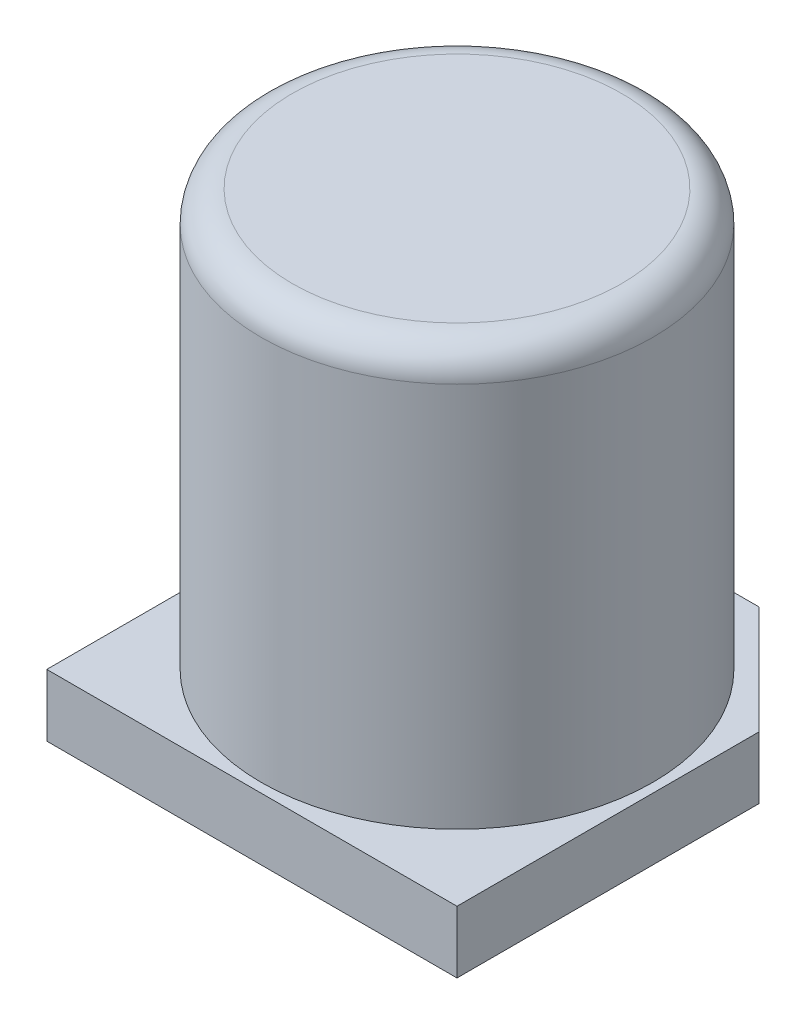
ISO-10303-21;
HEADER;
FILE_DESCRIPTION(('STEP AP214'),'2;1');
FILE_NAME('part.step','',(''),(''),'','','');
FILE_SCHEMA(('AUTOMOTIVE_DESIGN { 1 0 10303 214 1 1 1 1 }'));
ENDSEC;
DATA;
#1=APPLICATION_CONTEXT('core data for automotive mechanical design processes');
#2=APPLICATION_PROTOCOL_DEFINITION('international standard','automotive_design',2000,#1);
#3=PRODUCT_CONTEXT('',#1,'mechanical');
#4=PRODUCT('Part','Part','',(#3));
#5=PRODUCT_RELATED_PRODUCT_CATEGORY('part','',(#4));
#6=PRODUCT_DEFINITION_FORMATION('','',#4);
#7=PRODUCT_DEFINITION_CONTEXT('part definition',#1,'design');
#8=PRODUCT_DEFINITION('design','',#6,#7);
#9=PRODUCT_DEFINITION_SHAPE('','',#8);
#10=(LENGTH_UNIT() NAMED_UNIT(*) SI_UNIT(.MILLI.,.METRE.));
#11=(NAMED_UNIT(*) PLANE_ANGLE_UNIT() SI_UNIT($,.RADIAN.));
#12=(NAMED_UNIT(*) SI_UNIT($,.STERADIAN.) SOLID_ANGLE_UNIT());
#13=UNCERTAINTY_MEASURE_WITH_UNIT(LENGTH_MEASURE(1.E-05),#10,'distance_accuracy_value','');
#14=(GEOMETRIC_REPRESENTATION_CONTEXT(3) GLOBAL_UNCERTAINTY_ASSIGNED_CONTEXT((#13)) GLOBAL_UNIT_ASSIGNED_CONTEXT((#10,
#11,#12)) REPRESENTATION_CONTEXT('',''));
#15=CARTESIAN_POINT('',(0.,0.,0.));
#16=DIRECTION('',(0.,0.,1.));
#17=DIRECTION('',(1.,0.,0.));
#18=AXIS2_PLACEMENT_3D('',#15,#16,#17);
#19=CARTESIAN_POINT('',(3.3,1.,3.3));
#20=DIRECTION('',(0.,0.,1.));
#21=DIRECTION('',(1.,0.,0.));
#22=AXIS2_PLACEMENT_3D('',#19,#20,#21);
#23=PLANE('',#22);
#24=DIRECTION('',(-1.,0.,0.));
#25=VECTOR('',#24,1.);
#26=CARTESIAN_POINT('',(3.3,0.,3.3));
#27=LINE('',#26,#25);
#28=CARTESIAN_POINT('',(3.3,0.,3.3));
#29=VERTEX_POINT('',#28);
#30=CARTESIAN_POINT('',(-3.3,0.,3.3));
#31=VERTEX_POINT('',#30);
#32=EDGE_CURVE('E120',#29,#31,#27,.T.);
#33=ORIENTED_EDGE('',*,*,#32,.F.);
#34=DIRECTION('',(0.,-1.,0.));
#35=VECTOR('',#34,1.);
#36=CARTESIAN_POINT('',(3.3,1.,3.3));
#37=LINE('',#36,#35);
#38=CARTESIAN_POINT('',(3.3,1.,3.3));
#39=VERTEX_POINT('',#38);
#40=EDGE_CURVE('E100',#39,#29,#37,.T.);
#41=ORIENTED_EDGE('',*,*,#40,.F.);
#42=DIRECTION('',(-1.,0.,0.));
#43=VECTOR('',#42,1.);
#44=CARTESIAN_POINT('',(3.3,1.,3.3));
#45=LINE('',#44,#43);
#46=CARTESIAN_POINT('',(-3.3,1.,3.3));
#47=VERTEX_POINT('',#46);
#48=EDGE_CURVE('E105',#39,#47,#45,.T.);
#49=ORIENTED_EDGE('',*,*,#48,.T.);
#50=DIRECTION('',(0.,-1.,0.));
#51=VECTOR('',#50,1.);
#52=CARTESIAN_POINT('',(-3.3,1.,3.3));
#53=LINE('',#52,#51);
#54=EDGE_CURVE('E89',#47,#31,#53,.T.);
#55=ORIENTED_EDGE('',*,*,#54,.T.);
#56=EDGE_LOOP('',(#33,#41,#49,#55));
#57=FACE_BOUND('',#56,.T.);
#58=ADVANCED_FACE('F34',(#57),#23,.T.);
#59=CARTESIAN_POINT('',(3.3,1.,-3.3));
#60=DIRECTION('',(1.,0.,0.));
#61=DIRECTION('',(0.,0.,-1.));
#62=AXIS2_PLACEMENT_3D('',#59,#60,#61);
#63=PLANE('',#62);
#64=DIRECTION('',(0.,0.,1.));
#65=VECTOR('',#64,1.);
#66=CARTESIAN_POINT('',(3.3,0.,-3.3));
#67=LINE('',#66,#65);
#68=CARTESIAN_POINT('',(3.3,0.,-1.56254826892699));
#69=VERTEX_POINT('',#68);
#70=EDGE_CURVE('E110',#69,#29,#67,.T.);
#71=ORIENTED_EDGE('',*,*,#70,.F.);
#72=DIRECTION('',(0.,1.,0.));
#73=VECTOR('',#72,1.);
#74=CARTESIAN_POINT('',(3.3,1.,-1.56254826892699));
#75=LINE('',#74,#73);
#76=CARTESIAN_POINT('',(3.3,1.,-1.56254826892699));
#77=VERTEX_POINT('',#76);
#78=EDGE_CURVE('E57',#69,#77,#75,.T.);
#79=ORIENTED_EDGE('',*,*,#78,.T.);
#80=DIRECTION('',(0.,0.,1.));
#81=VECTOR('',#80,1.);
#82=CARTESIAN_POINT('',(3.3,1.,-3.3));
#83=LINE('',#82,#81);
#84=EDGE_CURVE('E101',#77,#39,#83,.T.);
#85=ORIENTED_EDGE('',*,*,#84,.T.);
#86=ORIENTED_EDGE('',*,*,#40,.T.);
#87=EDGE_LOOP('',(#71,#79,#85,#86));
#88=FACE_BOUND('',#87,.T.);
#89=ADVANCED_FACE('F156',(#88),#63,.T.);
#90=CARTESIAN_POINT('',(-3.3,1.,-3.3));
#91=DIRECTION('',(0.,0.,-1.));
#92=DIRECTION('',(-1.,0.,0.));
#93=AXIS2_PLACEMENT_3D('',#90,#91,#92);
#94=PLANE('',#93);
#95=DIRECTION('',(1.,0.,0.));
#96=VECTOR('',#95,1.);
#97=CARTESIAN_POINT('',(-3.3,1.,-3.3));
#98=LINE('',#97,#96);
#99=CARTESIAN_POINT('',(-1.56254826892699,1.,-3.3));
#100=VERTEX_POINT('',#99);
#101=CARTESIAN_POINT('',(1.56254826892701,1.,-3.3));
#102=VERTEX_POINT('',#101);
#103=EDGE_CURVE('E106',#100,#102,#98,.T.);
#104=ORIENTED_EDGE('',*,*,#103,.T.);
#105=DIRECTION('',(0.,-1.,0.));
#106=VECTOR('',#105,1.);
#107=CARTESIAN_POINT('',(1.56254826892701,1.,-3.3));
#108=LINE('',#107,#106);
#109=CARTESIAN_POINT('',(1.56254826892701,0.,-3.3));
#110=VERTEX_POINT('',#109);
#111=EDGE_CURVE('E128',#102,#110,#108,.T.);
#112=ORIENTED_EDGE('',*,*,#111,.T.);
#113=DIRECTION('',(1.,0.,0.));
#114=VECTOR('',#113,1.);
#115=CARTESIAN_POINT('',(-3.3,0.,-3.3));
#116=LINE('',#115,#114);
#117=CARTESIAN_POINT('',(-1.56254826892699,0.,-3.3));
#118=VERTEX_POINT('',#117);
#119=EDGE_CURVE('E112',#118,#110,#116,.T.);
#120=ORIENTED_EDGE('',*,*,#119,.F.);
#121=DIRECTION('',(0.,1.,0.));
#122=VECTOR('',#121,1.);
#123=CARTESIAN_POINT('',(-1.56254826892699,1.,-3.3));
#124=LINE('',#123,#122);
#125=EDGE_CURVE('E125',#118,#100,#124,.T.);
#126=ORIENTED_EDGE('',*,*,#125,.T.);
#127=EDGE_LOOP('',(#104,#112,#120,#126));
#128=FACE_BOUND('',#127,.T.);
#129=ADVANCED_FACE('F161',(#128),#94,.T.);
#130=CARTESIAN_POINT('',(-3.3,1.,3.3));
#131=DIRECTION('',(-1.,0.,0.));
#132=DIRECTION('',(0.,0.,1.));
#133=AXIS2_PLACEMENT_3D('',#130,#131,#132);
#134=PLANE('',#133);
#135=DIRECTION('',(0.,0.,-1.));
#136=VECTOR('',#135,1.);
#137=CARTESIAN_POINT('',(-3.3,1.,3.3));
#138=LINE('',#137,#136);
#139=CARTESIAN_POINT('',(-3.3,1.,-1.562548268927));
#140=VERTEX_POINT('',#139);
#141=EDGE_CURVE('E92',#47,#140,#138,.T.);
#142=ORIENTED_EDGE('',*,*,#141,.T.);
#143=DIRECTION('',(0.,-1.,0.));
#144=VECTOR('',#143,1.);
#145=CARTESIAN_POINT('',(-3.3,1.,-1.56254826892701));
#146=LINE('',#145,#144);
#147=CARTESIAN_POINT('',(-3.3,0.,-1.56254826892701));
#148=VERTEX_POINT('',#147);
#149=EDGE_CURVE('E139',#140,#148,#146,.T.);
#150=ORIENTED_EDGE('',*,*,#149,.T.);
#151=DIRECTION('',(0.,0.,-1.));
#152=VECTOR('',#151,1.);
#153=CARTESIAN_POINT('',(-3.3,0.,3.3));
#154=LINE('',#153,#152);
#155=EDGE_CURVE('E95',#31,#148,#154,.T.);
#156=ORIENTED_EDGE('',*,*,#155,.F.);
#157=ORIENTED_EDGE('',*,*,#54,.F.);
#158=EDGE_LOOP('',(#142,#150,#156,#157));
#159=FACE_BOUND('',#158,.T.);
#160=ADVANCED_FACE('F90',(#159),#134,.T.);
#161=CARTESIAN_POINT('',(0.,1.,0.));
#162=DIRECTION('',(0.,-1.,0.));
#163=DIRECTION('',(0.,0.,-1.));
#164=AXIS2_PLACEMENT_3D('',#161,#162,#163);
#165=PLANE('',#164);
#166=CARTESIAN_POINT('',(0.,1.,0.));
#167=DIRECTION('',(0.,-1.,0.));
#168=DIRECTION('',(0.,0.,-1.));
#169=AXIS2_PLACEMENT_3D('',#166,#167,#168);
#170=CIRCLE('',#169,3.15);
#171=CARTESIAN_POINT('',(0.,1.,-3.15));
#172=VERTEX_POINT('',#171);
#173=EDGE_CURVE('E115',#172,#172,#170,.T.);
#174=ORIENTED_EDGE('',*,*,#173,.T.);
#175=EDGE_LOOP('',(#174));
#176=FACE_BOUND('',#175,.T.);
#177=ORIENTED_EDGE('',*,*,#84,.F.);
#178=DIRECTION('',(0.707106781186545,0.,0.70710678118655));
#179=VECTOR('',#178,1.);
#180=CARTESIAN_POINT('',(1.56254826892701,1.,-3.3));
#181=LINE('',#180,#179);
#182=EDGE_CURVE('E137',#77,#102,#181,.F.);
#183=ORIENTED_EDGE('',*,*,#182,.T.);
#184=ORIENTED_EDGE('',*,*,#103,.F.);
#185=DIRECTION('',(0.70710678118655,0.,-0.707106781186545));
#186=VECTOR('',#185,1.);
#187=CARTESIAN_POINT('',(-3.3,1.,-1.56254826892701));
#188=LINE('',#187,#186);
#189=EDGE_CURVE('E49',#100,#140,#188,.F.);
#190=ORIENTED_EDGE('',*,*,#189,.T.);
#191=ORIENTED_EDGE('',*,*,#141,.F.);
#192=ORIENTED_EDGE('',*,*,#48,.F.);
#193=EDGE_LOOP('',(#177,#183,#184,#190,#191,#192));
#194=FACE_BOUND('',#193,.T.);
#195=ADVANCED_FACE('F104',(#176,#194),#165,.F.);
#196=CARTESIAN_POINT('',(0.,0.,0.));
#197=DIRECTION('',(0.,-1.,0.));
#198=DIRECTION('',(0.,0.,-1.));
#199=AXIS2_PLACEMENT_3D('',#196,#197,#198);
#200=PLANE('',#199);
#201=ORIENTED_EDGE('',*,*,#119,.T.);
#202=DIRECTION('',(-0.707106781186545,0.,-0.70710678118655));
#203=VECTOR('',#202,1.);
#204=CARTESIAN_POINT('',(2.43127413446351,0.,-2.43127413446349));
#205=LINE('',#204,#203);
#206=EDGE_CURVE('E133',#110,#69,#205,.F.);
#207=ORIENTED_EDGE('',*,*,#206,.T.);
#208=ORIENTED_EDGE('',*,*,#70,.T.);
#209=ORIENTED_EDGE('',*,*,#32,.T.);
#210=ORIENTED_EDGE('',*,*,#155,.T.);
#211=DIRECTION('',(-0.70710678118655,0.,0.707106781186545));
#212=VECTOR('',#211,1.);
#213=CARTESIAN_POINT('',(-2.43127413446349,0.,-2.43127413446351));
#214=LINE('',#213,#212);
#215=EDGE_CURVE('E131',#148,#118,#214,.F.);
#216=ORIENTED_EDGE('',*,*,#215,.T.);
#217=EDGE_LOOP('',(#201,#207,#208,#209,#210,#216));
#218=FACE_BOUND('',#217,.T.);
#219=ADVANCED_FACE('F180',(#218),#200,.T.);
#220=CARTESIAN_POINT('',(0.,7.7,0.));
#221=DIRECTION('',(0.,-1.,0.));
#222=DIRECTION('',(0.,0.,-1.));
#223=AXIS2_PLACEMENT_3D('',#220,#221,#222);
#224=CYLINDRICAL_SURFACE('',#223,3.15);
#225=CARTESIAN_POINT('',(0.,7.2,0.));
#226=DIRECTION('',(0.,1.,0.));
#227=DIRECTION('',(0.,0.,1.));
#228=AXIS2_PLACEMENT_3D('',#225,#226,#227);
#229=CIRCLE('',#228,3.15);
#230=CARTESIAN_POINT('',(0.,7.2,3.15));
#231=VERTEX_POINT('',#230);
#232=EDGE_CURVE('E42',#231,#231,#229,.F.);
#233=ORIENTED_EDGE('',*,*,#232,.T.);
#234=EDGE_LOOP('',(#233));
#235=FACE_BOUND('',#234,.T.);
#236=ORIENTED_EDGE('',*,*,#173,.F.);
#237=EDGE_LOOP('',(#236));
#238=FACE_BOUND('',#237,.T.);
#239=ADVANCED_FACE('F143',(#235,#238),#224,.T.);
#240=CARTESIAN_POINT('',(3.15,7.7,0.));
#241=DIRECTION('',(0.,1.,0.));
#242=DIRECTION('',(0.,0.,1.));
#243=AXIS2_PLACEMENT_3D('',#240,#241,#242);
#244=PLANE('',#243);
#245=CARTESIAN_POINT('',(0.,7.7,0.));
#246=DIRECTION('',(0.,1.,0.));
#247=DIRECTION('',(0.,0.,1.));
#248=AXIS2_PLACEMENT_3D('',#245,#246,#247);
#249=CIRCLE('',#248,2.65);
#250=CARTESIAN_POINT('',(0.,7.7,2.65));
#251=VERTEX_POINT('',#250);
#252=EDGE_CURVE('E11',#251,#251,#249,.T.);
#253=ORIENTED_EDGE('',*,*,#252,.T.);
#254=EDGE_LOOP('',(#253));
#255=FACE_BOUND('',#254,.T.);
#256=ADVANCED_FACE('F167',(#255),#244,.T.);
#257=CARTESIAN_POINT('',(1.56254826892701,1.,-3.3));
#258=DIRECTION('',(-0.70710678118655,0.,0.707106781186545));
#259=DIRECTION('',(0.,-1.,0.));
#260=AXIS2_PLACEMENT_3D('',#257,#258,#259);
#261=PLANE('',#260);
#262=ORIENTED_EDGE('',*,*,#182,.F.);
#263=ORIENTED_EDGE('',*,*,#78,.F.);
#264=ORIENTED_EDGE('',*,*,#206,.F.);
#265=ORIENTED_EDGE('',*,*,#111,.F.);
#266=EDGE_LOOP('',(#262,#263,#264,#265));
#267=FACE_BOUND('',#266,.T.);
#268=ADVANCED_FACE('F152',(#267),#261,.F.);
#269=CARTESIAN_POINT('',(-3.3,1.,-1.56254826892701));
#270=DIRECTION('',(0.707106781186545,0.,0.70710678118655));
#271=DIRECTION('',(0.,-1.,0.));
#272=AXIS2_PLACEMENT_3D('',#269,#270,#271);
#273=PLANE('',#272);
#274=ORIENTED_EDGE('',*,*,#189,.F.);
#275=ORIENTED_EDGE('',*,*,#125,.F.);
#276=ORIENTED_EDGE('',*,*,#215,.F.);
#277=ORIENTED_EDGE('',*,*,#149,.F.);
#278=EDGE_LOOP('',(#274,#275,#276,#277));
#279=FACE_BOUND('',#278,.T.);
#280=ADVANCED_FACE('F147',(#279),#273,.F.);
#281=CARTESIAN_POINT('',(0.,7.2,0.));
#282=DIRECTION('',(0.,1.,0.));
#283=DIRECTION('',(0.,0.,1.));
#284=AXIS2_PLACEMENT_3D('',#281,#282,#283);
#285=TOROIDAL_SURFACE('',#284,2.65,0.5);
#286=ORIENTED_EDGE('',*,*,#252,.F.);
#287=EDGE_LOOP('',(#286));
#288=FACE_BOUND('',#287,.T.);
#289=ORIENTED_EDGE('',*,*,#232,.F.);
#290=EDGE_LOOP('',(#289));
#291=FACE_BOUND('',#290,.T.);
#292=ADVANCED_FACE('F36',(#288,#291),#285,.T.);
#293=CLOSED_SHELL('',(#58,#89,#129,#160,#195,#219,#239,#256,#268,#280,#292));
#294=MANIFOLD_SOLID_BREP('B2',#293);
#295=ADVANCED_BREP_SHAPE_REPRESENTATION('',(#18,#294),#14);
#296=SHAPE_DEFINITION_REPRESENTATION(#9,#295);
ENDSEC;
END-ISO-10303-21;
